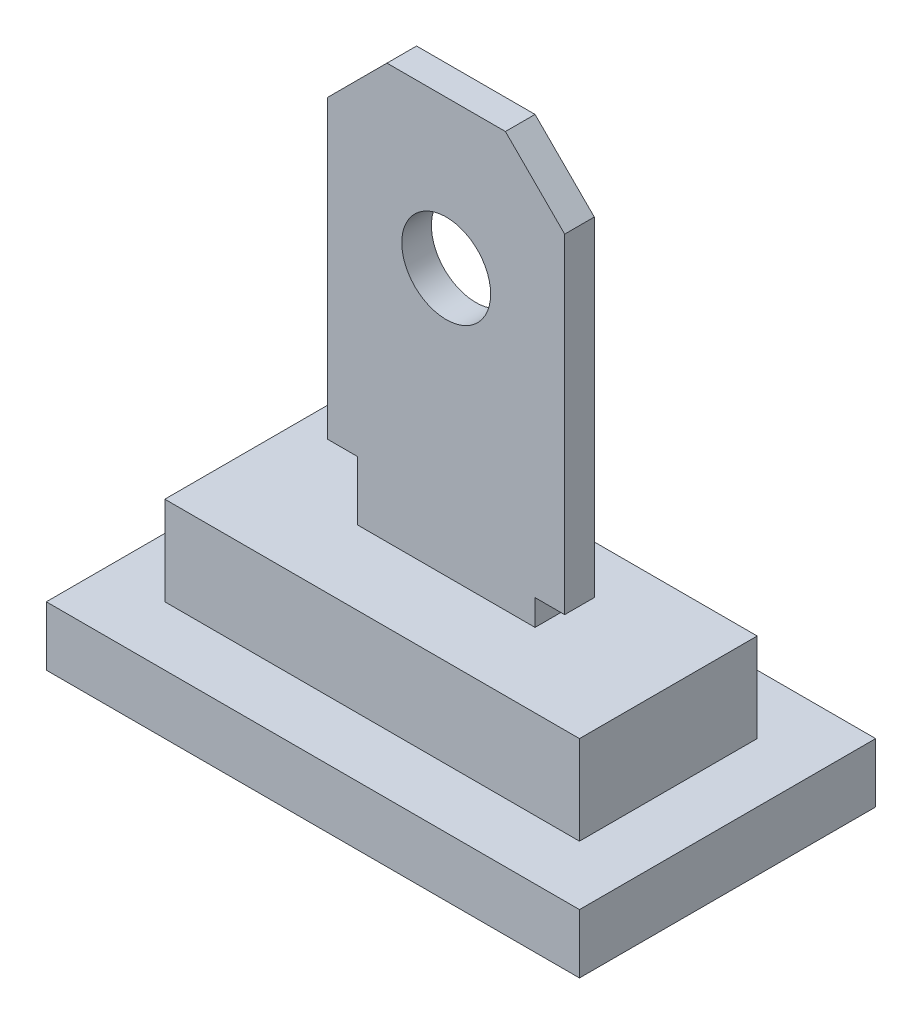
ISO-10303-21;
HEADER;
FILE_DESCRIPTION(('STEP AP214'),'2;1');
FILE_NAME('part.step','',(''),(''),'','','');
FILE_SCHEMA(('AUTOMOTIVE_DESIGN { 1 0 10303 214 1 1 1 1 }'));
ENDSEC;
DATA;
#1=APPLICATION_CONTEXT('core data for automotive mechanical design processes');
#2=APPLICATION_PROTOCOL_DEFINITION('international standard','automotive_design',2000,#1);
#3=PRODUCT_CONTEXT('',#1,'mechanical');
#4=PRODUCT('Part','Part','',(#3));
#5=PRODUCT_RELATED_PRODUCT_CATEGORY('part','',(#4));
#6=PRODUCT_DEFINITION_FORMATION('','',#4);
#7=PRODUCT_DEFINITION_CONTEXT('part definition',#1,'design');
#8=PRODUCT_DEFINITION('design','',#6,#7);
#9=PRODUCT_DEFINITION_SHAPE('','',#8);
#10=(LENGTH_UNIT() NAMED_UNIT(*) SI_UNIT(.MILLI.,.METRE.));
#11=(NAMED_UNIT(*) PLANE_ANGLE_UNIT() SI_UNIT($,.RADIAN.));
#12=(NAMED_UNIT(*) SI_UNIT($,.STERADIAN.) SOLID_ANGLE_UNIT());
#13=UNCERTAINTY_MEASURE_WITH_UNIT(LENGTH_MEASURE(1.E-05),#10,'distance_accuracy_value','');
#14=(GEOMETRIC_REPRESENTATION_CONTEXT(3) GLOBAL_UNCERTAINTY_ASSIGNED_CONTEXT((#13)) GLOBAL_UNIT_ASSIGNED_CONTEXT((#10,
#11,#12)) REPRESENTATION_CONTEXT('',''));
#15=CARTESIAN_POINT('',(0.,0.,0.));
#16=DIRECTION('',(0.,0.,1.));
#17=DIRECTION('',(1.,0.,0.));
#18=AXIS2_PLACEMENT_3D('',#15,#16,#17);
#19=CARTESIAN_POINT('',(0.,1.5,0.));
#20=DIRECTION('',(0.,1.,0.));
#21=DIRECTION('',(0.,0.,1.));
#22=AXIS2_PLACEMENT_3D('',#19,#20,#21);
#23=PLANE('',#22);
#24=DIRECTION('',(0.,0.,-1.));
#25=VECTOR('',#24,1.);
#26=CARTESIAN_POINT('',(3.5,1.5,-1.5));
#27=LINE('',#26,#25);
#28=CARTESIAN_POINT('',(3.5,1.5,1.5));
#29=VERTEX_POINT('',#28);
#30=CARTESIAN_POINT('',(3.5,1.5,-1.5));
#31=VERTEX_POINT('',#30);
#32=EDGE_CURVE('E89',#29,#31,#27,.T.);
#33=ORIENTED_EDGE('',*,*,#32,.T.);
#34=DIRECTION('',(-1.,0.,0.));
#35=VECTOR('',#34,1.);
#36=CARTESIAN_POINT('',(-3.5,1.5,-1.5));
#37=LINE('',#36,#35);
#38=CARTESIAN_POINT('',(-3.5,1.5,-1.5));
#39=VERTEX_POINT('',#38);
#40=EDGE_CURVE('E82',#31,#39,#37,.T.);
#41=ORIENTED_EDGE('',*,*,#40,.T.);
#42=DIRECTION('',(0.,0.,1.));
#43=VECTOR('',#42,1.);
#44=CARTESIAN_POINT('',(-3.5,1.5,-1.5));
#45=LINE('',#44,#43);
#46=CARTESIAN_POINT('',(-3.5,1.5,1.5));
#47=VERTEX_POINT('',#46);
#48=EDGE_CURVE('E86',#39,#47,#45,.T.);
#49=ORIENTED_EDGE('',*,*,#48,.T.);
#50=DIRECTION('',(1.,0.,0.));
#51=VECTOR('',#50,1.);
#52=CARTESIAN_POINT('',(-3.5,1.5,1.5));
#53=LINE('',#52,#51);
#54=EDGE_CURVE('E56',#47,#29,#53,.T.);
#55=ORIENTED_EDGE('',*,*,#54,.T.);
#56=EDGE_LOOP('',(#33,#41,#49,#55));
#57=FACE_BOUND('',#56,.T.);
#58=DIRECTION('',(1.,0.,0.));
#59=VECTOR('',#58,1.);
#60=CARTESIAN_POINT('',(1.5,1.5,-0.25));
#61=LINE('',#60,#59);
#62=CARTESIAN_POINT('',(-1.5,1.5,-0.25));
#63=VERTEX_POINT('',#62);
#64=CARTESIAN_POINT('',(1.5,1.5,-0.25));
#65=VERTEX_POINT('',#64);
#66=EDGE_CURVE('E47',#63,#65,#61,.T.);
#67=ORIENTED_EDGE('',*,*,#66,.T.);
#68=DIRECTION('',(0.,0.,-1.));
#69=VECTOR('',#68,1.);
#70=CARTESIAN_POINT('',(1.5,1.5,0.25));
#71=LINE('',#70,#69);
#72=CARTESIAN_POINT('',(1.5,1.5,0.25));
#73=VERTEX_POINT('',#72);
#74=EDGE_CURVE('E203',#73,#65,#71,.T.);
#75=ORIENTED_EDGE('',*,*,#74,.F.);
#76=DIRECTION('',(1.,0.,0.));
#77=VECTOR('',#76,1.);
#78=CARTESIAN_POINT('',(1.5,1.5,0.25));
#79=LINE('',#78,#77);
#80=CARTESIAN_POINT('',(-1.5,1.5,0.25));
#81=VERTEX_POINT('',#80);
#82=EDGE_CURVE('E209',#81,#73,#79,.T.);
#83=ORIENTED_EDGE('',*,*,#82,.F.);
#84=DIRECTION('',(0.,0.,-1.));
#85=VECTOR('',#84,1.);
#86=CARTESIAN_POINT('',(-1.5,1.5,0.25));
#87=LINE('',#86,#85);
#88=EDGE_CURVE('E484',#81,#63,#87,.T.);
#89=ORIENTED_EDGE('',*,*,#88,.T.);
#90=EDGE_LOOP('',(#67,#75,#83,#89));
#91=FACE_BOUND('',#90,.T.);
#92=ADVANCED_FACE('F32',(#57,#91),#23,.T.);
#93=CARTESIAN_POINT('',(3.5,1.5,-1.5));
#94=DIRECTION('',(-1.,0.,0.));
#95=DIRECTION('',(0.,0.,1.));
#96=AXIS2_PLACEMENT_3D('',#93,#94,#95);
#97=PLANE('',#96);
#98=DIRECTION('',(0.,0.,-1.));
#99=VECTOR('',#98,1.);
#100=CARTESIAN_POINT('',(3.5,0.,-1.5));
#101=LINE('',#100,#99);
#102=CARTESIAN_POINT('',(3.5,0.,1.5));
#103=VERTEX_POINT('',#102);
#104=CARTESIAN_POINT('',(3.5,0.,-1.5));
#105=VERTEX_POINT('',#104);
#106=EDGE_CURVE('E69',#103,#105,#101,.T.);
#107=ORIENTED_EDGE('',*,*,#106,.T.);
#108=DIRECTION('',(0.,-1.,0.));
#109=VECTOR('',#108,1.);
#110=CARTESIAN_POINT('',(3.5,1.5,-1.5));
#111=LINE('',#110,#109);
#112=EDGE_CURVE('E11',#31,#105,#111,.T.);
#113=ORIENTED_EDGE('',*,*,#112,.F.);
#114=ORIENTED_EDGE('',*,*,#32,.F.);
#115=DIRECTION('',(0.,-1.,0.));
#116=VECTOR('',#115,1.);
#117=CARTESIAN_POINT('',(3.5,1.5,1.5));
#118=LINE('',#117,#116);
#119=EDGE_CURVE('E101',#29,#103,#118,.T.);
#120=ORIENTED_EDGE('',*,*,#119,.T.);
#121=EDGE_LOOP('',(#107,#113,#114,#120));
#122=FACE_BOUND('',#121,.T.);
#123=ADVANCED_FACE('F34',(#122),#97,.F.);
#124=CARTESIAN_POINT('',(-3.5,1.5,-1.5));
#125=DIRECTION('',(0.,0.,1.));
#126=DIRECTION('',(1.,0.,0.));
#127=AXIS2_PLACEMENT_3D('',#124,#125,#126);
#128=PLANE('',#127);
#129=DIRECTION('',(-1.,0.,0.));
#130=VECTOR('',#129,1.);
#131=CARTESIAN_POINT('',(-3.5,0.,-1.5));
#132=LINE('',#131,#130);
#133=CARTESIAN_POINT('',(-3.5,0.,-1.5));
#134=VERTEX_POINT('',#133);
#135=EDGE_CURVE('E77',#105,#134,#132,.T.);
#136=ORIENTED_EDGE('',*,*,#135,.T.);
#137=DIRECTION('',(0.,-1.,0.));
#138=VECTOR('',#137,1.);
#139=CARTESIAN_POINT('',(-3.5,1.5,-1.5));
#140=LINE('',#139,#138);
#141=EDGE_CURVE('E40',#39,#134,#140,.T.);
#142=ORIENTED_EDGE('',*,*,#141,.F.);
#143=ORIENTED_EDGE('',*,*,#40,.F.);
#144=ORIENTED_EDGE('',*,*,#112,.T.);
#145=EDGE_LOOP('',(#136,#142,#143,#144));
#146=FACE_BOUND('',#145,.T.);
#147=ADVANCED_FACE('F94',(#146),#128,.F.);
#148=CARTESIAN_POINT('',(-3.5,1.5,-1.5));
#149=DIRECTION('',(1.,0.,0.));
#150=DIRECTION('',(0.,0.,-1.));
#151=AXIS2_PLACEMENT_3D('',#148,#149,#150);
#152=PLANE('',#151);
#153=DIRECTION('',(0.,0.,1.));
#154=VECTOR('',#153,1.);
#155=CARTESIAN_POINT('',(-3.5,0.,-1.5));
#156=LINE('',#155,#154);
#157=CARTESIAN_POINT('',(-3.5,0.,1.5));
#158=VERTEX_POINT('',#157);
#159=EDGE_CURVE('E108',#134,#158,#156,.T.);
#160=ORIENTED_EDGE('',*,*,#159,.T.);
#161=DIRECTION('',(0.,-1.,0.));
#162=VECTOR('',#161,1.);
#163=CARTESIAN_POINT('',(-3.5,1.5,1.5));
#164=LINE('',#163,#162);
#165=EDGE_CURVE('E97',#47,#158,#164,.T.);
#166=ORIENTED_EDGE('',*,*,#165,.F.);
#167=ORIENTED_EDGE('',*,*,#48,.F.);
#168=ORIENTED_EDGE('',*,*,#141,.T.);
#169=EDGE_LOOP('',(#160,#166,#167,#168));
#170=FACE_BOUND('',#169,.T.);
#171=ADVANCED_FACE('F98',(#170),#152,.F.);
#172=CARTESIAN_POINT('',(-3.5,1.5,1.5));
#173=DIRECTION('',(0.,0.,-1.));
#174=DIRECTION('',(-1.,0.,0.));
#175=AXIS2_PLACEMENT_3D('',#172,#173,#174);
#176=PLANE('',#175);
#177=DIRECTION('',(1.,0.,0.));
#178=VECTOR('',#177,1.);
#179=CARTESIAN_POINT('',(-3.5,0.,1.5));
#180=LINE('',#179,#178);
#181=EDGE_CURVE('E110',#158,#103,#180,.T.);
#182=ORIENTED_EDGE('',*,*,#181,.T.);
#183=ORIENTED_EDGE('',*,*,#119,.F.);
#184=ORIENTED_EDGE('',*,*,#54,.F.);
#185=ORIENTED_EDGE('',*,*,#165,.T.);
#186=EDGE_LOOP('',(#182,#183,#184,#185));
#187=FACE_BOUND('',#186,.T.);
#188=ADVANCED_FACE('F115',(#187),#176,.F.);
#189=CARTESIAN_POINT('',(0.,0.,0.));
#190=DIRECTION('',(0.,-1.,0.));
#191=DIRECTION('',(0.,0.,-1.));
#192=AXIS2_PLACEMENT_3D('',#189,#190,#191);
#193=PLANE('',#192);
#194=DIRECTION('',(0.,0.,1.));
#195=VECTOR('',#194,1.);
#196=CARTESIAN_POINT('',(4.5,0.,2.5));
#197=LINE('',#196,#195);
#198=CARTESIAN_POINT('',(4.5,0.,-2.5));
#199=VERTEX_POINT('',#198);
#200=CARTESIAN_POINT('',(4.5,0.,2.5));
#201=VERTEX_POINT('',#200);
#202=EDGE_CURVE('E220',#199,#201,#197,.T.);
#203=ORIENTED_EDGE('',*,*,#202,.F.);
#204=DIRECTION('',(1.,0.,0.));
#205=VECTOR('',#204,1.);
#206=CARTESIAN_POINT('',(-4.5,0.,-2.5));
#207=LINE('',#206,#205);
#208=CARTESIAN_POINT('',(-4.5,0.,-2.5));
#209=VERTEX_POINT('',#208);
#210=EDGE_CURVE('E233',#209,#199,#207,.T.);
#211=ORIENTED_EDGE('',*,*,#210,.F.);
#212=DIRECTION('',(0.,0.,-1.));
#213=VECTOR('',#212,1.);
#214=CARTESIAN_POINT('',(-4.5,0.,2.5));
#215=LINE('',#214,#213);
#216=CARTESIAN_POINT('',(-4.5,0.,2.5));
#217=VERTEX_POINT('',#216);
#218=EDGE_CURVE('E241',#217,#209,#215,.T.);
#219=ORIENTED_EDGE('',*,*,#218,.F.);
#220=DIRECTION('',(-1.,0.,0.));
#221=VECTOR('',#220,1.);
#222=CARTESIAN_POINT('',(-4.5,0.,2.5));
#223=LINE('',#222,#221);
#224=EDGE_CURVE('E223',#201,#217,#223,.T.);
#225=ORIENTED_EDGE('',*,*,#224,.F.);
#226=EDGE_LOOP('',(#203,#211,#219,#225));
#227=FACE_BOUND('',#226,.T.);
#228=ORIENTED_EDGE('',*,*,#135,.F.);
#229=ORIENTED_EDGE('',*,*,#106,.F.);
#230=ORIENTED_EDGE('',*,*,#181,.F.);
#231=ORIENTED_EDGE('',*,*,#159,.F.);
#232=EDGE_LOOP('',(#228,#229,#230,#231));
#233=FACE_BOUND('',#232,.T.);
#234=ADVANCED_FACE('F264',(#227,#233),#193,.F.);
#235=CARTESIAN_POINT('',(4.5,-1.,2.5));
#236=DIRECTION('',(-1.,0.,0.));
#237=DIRECTION('',(0.,0.,1.));
#238=AXIS2_PLACEMENT_3D('',#235,#236,#237);
#239=PLANE('',#238);
#240=ORIENTED_EDGE('',*,*,#202,.T.);
#241=DIRECTION('',(0.,1.,0.));
#242=VECTOR('',#241,1.);
#243=CARTESIAN_POINT('',(4.5,-1.,2.5));
#244=LINE('',#243,#242);
#245=CARTESIAN_POINT('',(4.5,-1.,2.5));
#246=VERTEX_POINT('',#245);
#247=EDGE_CURVE('E106',#246,#201,#244,.T.);
#248=ORIENTED_EDGE('',*,*,#247,.F.);
#249=DIRECTION('',(0.,0.,1.));
#250=VECTOR('',#249,1.);
#251=CARTESIAN_POINT('',(4.5,-1.,2.5));
#252=LINE('',#251,#250);
#253=CARTESIAN_POINT('',(4.5,-1.,-2.5));
#254=VERTEX_POINT('',#253);
#255=EDGE_CURVE('E229',#254,#246,#252,.T.);
#256=ORIENTED_EDGE('',*,*,#255,.F.);
#257=DIRECTION('',(0.,1.,0.));
#258=VECTOR('',#257,1.);
#259=CARTESIAN_POINT('',(4.5,-1.,-2.5));
#260=LINE('',#259,#258);
#261=EDGE_CURVE('E238',#254,#199,#260,.T.);
#262=ORIENTED_EDGE('',*,*,#261,.T.);
#263=EDGE_LOOP('',(#240,#248,#256,#262));
#264=FACE_BOUND('',#263,.T.);
#265=ADVANCED_FACE('F260',(#264),#239,.F.);
#266=CARTESIAN_POINT('',(-4.5,-1.,2.5));
#267=DIRECTION('',(0.,0.,-1.));
#268=DIRECTION('',(-1.,0.,0.));
#269=AXIS2_PLACEMENT_3D('',#266,#267,#268);
#270=PLANE('',#269);
#271=ORIENTED_EDGE('',*,*,#224,.T.);
#272=DIRECTION('',(0.,1.,0.));
#273=VECTOR('',#272,1.);
#274=CARTESIAN_POINT('',(-4.5,-1.,2.5));
#275=LINE('',#274,#273);
#276=CARTESIAN_POINT('',(-4.5,-1.,2.5));
#277=VERTEX_POINT('',#276);
#278=EDGE_CURVE('E249',#277,#217,#275,.T.);
#279=ORIENTED_EDGE('',*,*,#278,.F.);
#280=DIRECTION('',(-1.,0.,0.));
#281=VECTOR('',#280,1.);
#282=CARTESIAN_POINT('',(-4.5,-1.,2.5));
#283=LINE('',#282,#281);
#284=EDGE_CURVE('E232',#246,#277,#283,.T.);
#285=ORIENTED_EDGE('',*,*,#284,.F.);
#286=ORIENTED_EDGE('',*,*,#247,.T.);
#287=EDGE_LOOP('',(#271,#279,#285,#286));
#288=FACE_BOUND('',#287,.T.);
#289=ADVANCED_FACE('F255',(#288),#270,.F.);
#290=CARTESIAN_POINT('',(-4.5,-1.,2.5));
#291=DIRECTION('',(1.,0.,0.));
#292=DIRECTION('',(0.,0.,-1.));
#293=AXIS2_PLACEMENT_3D('',#290,#291,#292);
#294=PLANE('',#293);
#295=ORIENTED_EDGE('',*,*,#218,.T.);
#296=DIRECTION('',(0.,1.,0.));
#297=VECTOR('',#296,1.);
#298=CARTESIAN_POINT('',(-4.5,-1.,-2.5));
#299=LINE('',#298,#297);
#300=CARTESIAN_POINT('',(-4.5,-1.,-2.5));
#301=VERTEX_POINT('',#300);
#302=EDGE_CURVE('E246',#301,#209,#299,.T.);
#303=ORIENTED_EDGE('',*,*,#302,.F.);
#304=DIRECTION('',(0.,0.,-1.));
#305=VECTOR('',#304,1.);
#306=CARTESIAN_POINT('',(-4.5,-1.,2.5));
#307=LINE('',#306,#305);
#308=EDGE_CURVE('E235',#277,#301,#307,.T.);
#309=ORIENTED_EDGE('',*,*,#308,.F.);
#310=ORIENTED_EDGE('',*,*,#278,.T.);
#311=EDGE_LOOP('',(#295,#303,#309,#310));
#312=FACE_BOUND('',#311,.T.);
#313=ADVANCED_FACE('F268',(#312),#294,.F.);
#314=CARTESIAN_POINT('',(-4.5,-1.,-2.5));
#315=DIRECTION('',(0.,0.,1.));
#316=DIRECTION('',(1.,0.,0.));
#317=AXIS2_PLACEMENT_3D('',#314,#315,#316);
#318=PLANE('',#317);
#319=ORIENTED_EDGE('',*,*,#210,.T.);
#320=ORIENTED_EDGE('',*,*,#261,.F.);
#321=DIRECTION('',(1.,0.,0.));
#322=VECTOR('',#321,1.);
#323=CARTESIAN_POINT('',(-4.5,-1.,-2.5));
#324=LINE('',#323,#322);
#325=EDGE_CURVE('E237',#301,#254,#324,.T.);
#326=ORIENTED_EDGE('',*,*,#325,.F.);
#327=ORIENTED_EDGE('',*,*,#302,.T.);
#328=EDGE_LOOP('',(#319,#320,#326,#327));
#329=FACE_BOUND('',#328,.T.);
#330=ADVANCED_FACE('F272',(#329),#318,.F.);
#331=CARTESIAN_POINT('',(0.,-1.,0.));
#332=DIRECTION('',(0.,-1.,0.));
#333=DIRECTION('',(0.,0.,-1.));
#334=AXIS2_PLACEMENT_3D('',#331,#332,#333);
#335=PLANE('',#334);
#336=ORIENTED_EDGE('',*,*,#255,.T.);
#337=ORIENTED_EDGE('',*,*,#284,.T.);
#338=ORIENTED_EDGE('',*,*,#308,.T.);
#339=ORIENTED_EDGE('',*,*,#325,.T.);
#340=EDGE_LOOP('',(#336,#337,#338,#339));
#341=FACE_BOUND('',#340,.T.);
#342=ADVANCED_FACE('F274',(#341),#335,.T.);
#343=CARTESIAN_POINT('',(0.,0.,0.25));
#344=DIRECTION('',(0.,0.,-1.));
#345=DIRECTION('',(-1.,0.,0.));
#346=AXIS2_PLACEMENT_3D('',#343,#344,#345);
#347=PLANE('',#346);
#348=ORIENTED_EDGE('',*,*,#82,.T.);
#349=DIRECTION('',(0.,1.,0.));
#350=VECTOR('',#349,1.);
#351=CARTESIAN_POINT('',(1.5,1.9363915112357,0.25));
#352=LINE('',#351,#350);
#353=CARTESIAN_POINT('',(1.5,1.9363915112357,0.25));
#354=VERTEX_POINT('',#353);
#355=EDGE_CURVE('E199',#73,#354,#352,.T.);
#356=ORIENTED_EDGE('',*,*,#355,.T.);
#357=DIRECTION('',(1.,0.,0.));
#358=VECTOR('',#357,1.);
#359=CARTESIAN_POINT('',(2.,1.9363915112357,0.25));
#360=LINE('',#359,#358);
#361=CARTESIAN_POINT('',(2.,1.9363915112357,0.25));
#362=VERTEX_POINT('',#361);
#363=EDGE_CURVE('E208',#354,#362,#360,.T.);
#364=ORIENTED_EDGE('',*,*,#363,.T.);
#365=DIRECTION('',(0.,1.,0.));
#366=VECTOR('',#365,1.);
#367=CARTESIAN_POINT('',(2.,7.50000000000001,0.25));
#368=LINE('',#367,#366);
#369=CARTESIAN_POINT('',(2.,7.50000000000001,0.25));
#370=VERTEX_POINT('',#369);
#371=EDGE_CURVE('E471',#362,#370,#368,.T.);
#372=ORIENTED_EDGE('',*,*,#371,.T.);
#373=DIRECTION('',(-0.707106781186549,0.707106781186546,0.));
#374=VECTOR('',#373,1.);
#375=CARTESIAN_POINT('',(1.,8.5,0.25));
#376=LINE('',#375,#374);
#377=CARTESIAN_POINT('',(1.,8.5,0.25));
#378=VERTEX_POINT('',#377);
#379=EDGE_CURVE('E473',#370,#378,#376,.T.);
#380=ORIENTED_EDGE('',*,*,#379,.T.);
#381=DIRECTION('',(-1.,0.,0.));
#382=VECTOR('',#381,1.);
#383=CARTESIAN_POINT('',(-1.,8.5,0.25));
#384=LINE('',#383,#382);
#385=CARTESIAN_POINT('',(-1.,8.5,0.25));
#386=VERTEX_POINT('',#385);
#387=EDGE_CURVE('E475',#378,#386,#384,.T.);
#388=ORIENTED_EDGE('',*,*,#387,.T.);
#389=DIRECTION('',(-0.707106781186548,-0.707106781186547,0.));
#390=VECTOR('',#389,1.);
#391=CARTESIAN_POINT('',(-2.,7.5,0.25));
#392=LINE('',#391,#390);
#393=CARTESIAN_POINT('',(-2.,7.5,0.25));
#394=VERTEX_POINT('',#393);
#395=EDGE_CURVE('E477',#386,#394,#392,.T.);
#396=ORIENTED_EDGE('',*,*,#395,.T.);
#397=DIRECTION('',(0.,-1.,0.));
#398=VECTOR('',#397,1.);
#399=CARTESIAN_POINT('',(-2.,2.5,0.25));
#400=LINE('',#399,#398);
#401=CARTESIAN_POINT('',(-2.,2.5,0.25));
#402=VERTEX_POINT('',#401);
#403=EDGE_CURVE('E479',#394,#402,#400,.T.);
#404=ORIENTED_EDGE('',*,*,#403,.T.);
#405=DIRECTION('',(1.,0.,0.));
#406=VECTOR('',#405,1.);
#407=CARTESIAN_POINT('',(-1.5,2.5,0.25));
#408=LINE('',#407,#406);
#409=CARTESIAN_POINT('',(-1.5,2.5,0.25));
#410=VERTEX_POINT('',#409);
#411=EDGE_CURVE('E481',#402,#410,#408,.T.);
#412=ORIENTED_EDGE('',*,*,#411,.T.);
#413=DIRECTION('',(0.,-1.,0.));
#414=VECTOR('',#413,1.);
#415=CARTESIAN_POINT('',(-1.5,1.5,0.25));
#416=LINE('',#415,#414);
#417=EDGE_CURVE('E215',#410,#81,#416,.T.);
#418=ORIENTED_EDGE('',*,*,#417,.T.);
#419=EDGE_LOOP('',(#348,#356,#364,#372,#380,#388,#396,#404,#412,#418));
#420=FACE_BOUND('',#419,.T.);
#421=CARTESIAN_POINT('',(0.,6.,0.25));
#422=DIRECTION('',(0.,0.,1.));
#423=DIRECTION('',(1.,0.,0.));
#424=AXIS2_PLACEMENT_3D('',#421,#422,#423);
#425=CIRCLE('',#424,0.75);
#426=CARTESIAN_POINT('',(0.75,6.,0.25));
#427=VERTEX_POINT('',#426);
#428=EDGE_CURVE('E462',#427,#427,#425,.T.);
#429=ORIENTED_EDGE('',*,*,#428,.F.);
#430=EDGE_LOOP('',(#429));
#431=FACE_BOUND('',#430,.T.);
#432=ADVANCED_FACE('F212',(#420,#431),#347,.F.);
#433=CARTESIAN_POINT('',(0.,0.,-0.25));
#434=DIRECTION('',(0.,0.,-1.));
#435=DIRECTION('',(-1.,0.,0.));
#436=AXIS2_PLACEMENT_3D('',#433,#434,#435);
#437=PLANE('',#436);
#438=ORIENTED_EDGE('',*,*,#66,.F.);
#439=DIRECTION('',(0.,-1.,0.));
#440=VECTOR('',#439,1.);
#441=CARTESIAN_POINT('',(-1.5,1.5,-0.25));
#442=LINE('',#441,#440);
#443=CARTESIAN_POINT('',(-1.5,2.5,-0.25));
#444=VERTEX_POINT('',#443);
#445=EDGE_CURVE('E218',#444,#63,#442,.T.);
#446=ORIENTED_EDGE('',*,*,#445,.F.);
#447=DIRECTION('',(1.,0.,0.));
#448=VECTOR('',#447,1.);
#449=CARTESIAN_POINT('',(-1.5,2.5,-0.25));
#450=LINE('',#449,#448);
#451=CARTESIAN_POINT('',(-2.,2.5,-0.25));
#452=VERTEX_POINT('',#451);
#453=EDGE_CURVE('E500',#452,#444,#450,.T.);
#454=ORIENTED_EDGE('',*,*,#453,.F.);
#455=DIRECTION('',(0.,-1.,0.));
#456=VECTOR('',#455,1.);
#457=CARTESIAN_POINT('',(-2.,2.5,-0.25));
#458=LINE('',#457,#456);
#459=CARTESIAN_POINT('',(-2.,7.5,-0.25));
#460=VERTEX_POINT('',#459);
#461=EDGE_CURVE('E498',#460,#452,#458,.T.);
#462=ORIENTED_EDGE('',*,*,#461,.F.);
#463=DIRECTION('',(-0.707106781186548,-0.707106781186547,0.));
#464=VECTOR('',#463,1.);
#465=CARTESIAN_POINT('',(-2.,7.5,-0.25));
#466=LINE('',#465,#464);
#467=CARTESIAN_POINT('',(-1.,8.5,-0.25));
#468=VERTEX_POINT('',#467);
#469=EDGE_CURVE('E496',#468,#460,#466,.T.);
#470=ORIENTED_EDGE('',*,*,#469,.F.);
#471=DIRECTION('',(-1.,0.,0.));
#472=VECTOR('',#471,1.);
#473=CARTESIAN_POINT('',(-1.,8.5,-0.25));
#474=LINE('',#473,#472);
#475=CARTESIAN_POINT('',(1.,8.5,-0.25));
#476=VERTEX_POINT('',#475);
#477=EDGE_CURVE('E494',#476,#468,#474,.T.);
#478=ORIENTED_EDGE('',*,*,#477,.F.);
#479=DIRECTION('',(-0.707106781186549,0.707106781186546,0.));
#480=VECTOR('',#479,1.);
#481=CARTESIAN_POINT('',(1.,8.5,-0.25));
#482=LINE('',#481,#480);
#483=CARTESIAN_POINT('',(2.,7.50000000000001,-0.25));
#484=VERTEX_POINT('',#483);
#485=EDGE_CURVE('E492',#484,#476,#482,.T.);
#486=ORIENTED_EDGE('',*,*,#485,.F.);
#487=DIRECTION('',(0.,1.,0.));
#488=VECTOR('',#487,1.);
#489=CARTESIAN_POINT('',(2.,7.50000000000001,-0.25));
#490=LINE('',#489,#488);
#491=CARTESIAN_POINT('',(2.,1.9363915112357,-0.25));
#492=VERTEX_POINT('',#491);
#493=EDGE_CURVE('E490',#492,#484,#490,.T.);
#494=ORIENTED_EDGE('',*,*,#493,.F.);
#495=DIRECTION('',(1.,0.,0.));
#496=VECTOR('',#495,1.);
#497=CARTESIAN_POINT('',(2.,1.9363915112357,-0.25));
#498=LINE('',#497,#496);
#499=CARTESIAN_POINT('',(1.5,1.9363915112357,-0.25));
#500=VERTEX_POINT('',#499);
#501=EDGE_CURVE('E488',#500,#492,#498,.T.);
#502=ORIENTED_EDGE('',*,*,#501,.F.);
#503=DIRECTION('',(0.,1.,0.));
#504=VECTOR('',#503,1.);
#505=CARTESIAN_POINT('',(1.5,1.9363915112357,-0.25));
#506=LINE('',#505,#504);
#507=EDGE_CURVE('E486',#65,#500,#506,.T.);
#508=ORIENTED_EDGE('',*,*,#507,.F.);
#509=EDGE_LOOP('',(#438,#446,#454,#462,#470,#478,#486,#494,#502,#508));
#510=FACE_BOUND('',#509,.T.);
#511=CARTESIAN_POINT('',(0.,6.,-0.25));
#512=DIRECTION('',(0.,0.,1.));
#513=DIRECTION('',(1.,0.,0.));
#514=AXIS2_PLACEMENT_3D('',#511,#512,#513);
#515=CIRCLE('',#514,0.75);
#516=CARTESIAN_POINT('',(0.75,6.,-0.25));
#517=VERTEX_POINT('',#516);
#518=EDGE_CURVE('E465',#517,#517,#515,.T.);
#519=ORIENTED_EDGE('',*,*,#518,.T.);
#520=EDGE_LOOP('',(#519));
#521=FACE_BOUND('',#520,.T.);
#522=ADVANCED_FACE('F281',(#510,#521),#437,.T.);
#523=CARTESIAN_POINT('',(1.5,1.9363915112357,0.25));
#524=DIRECTION('',(-1.,0.,0.));
#525=DIRECTION('',(0.,-1.,0.));
#526=AXIS2_PLACEMENT_3D('',#523,#524,#525);
#527=PLANE('',#526);
#528=ORIENTED_EDGE('',*,*,#507,.T.);
#529=DIRECTION('',(0.,0.,-1.));
#530=VECTOR('',#529,1.);
#531=CARTESIAN_POINT('',(1.5,1.9363915112357,0.25));
#532=LINE('',#531,#530);
#533=EDGE_CURVE('E205',#354,#500,#532,.T.);
#534=ORIENTED_EDGE('',*,*,#533,.F.);
#535=ORIENTED_EDGE('',*,*,#355,.F.);
#536=ORIENTED_EDGE('',*,*,#74,.T.);
#537=EDGE_LOOP('',(#528,#534,#535,#536));
#538=FACE_BOUND('',#537,.T.);
#539=ADVANCED_FACE('F201',(#538),#527,.F.);
#540=CARTESIAN_POINT('',(2.,1.9363915112357,0.25));
#541=DIRECTION('',(0.,1.,0.));
#542=DIRECTION('',(0.,0.,1.));
#543=AXIS2_PLACEMENT_3D('',#540,#541,#542);
#544=PLANE('',#543);
#545=ORIENTED_EDGE('',*,*,#501,.T.);
#546=DIRECTION('',(0.,0.,-1.));
#547=VECTOR('',#546,1.);
#548=CARTESIAN_POINT('',(2.,1.9363915112357,0.25));
#549=LINE('',#548,#547);
#550=EDGE_CURVE('E225',#362,#492,#549,.T.);
#551=ORIENTED_EDGE('',*,*,#550,.F.);
#552=ORIENTED_EDGE('',*,*,#363,.F.);
#553=ORIENTED_EDGE('',*,*,#533,.T.);
#554=EDGE_LOOP('',(#545,#551,#552,#553));
#555=FACE_BOUND('',#554,.T.);
#556=ADVANCED_FACE('F367',(#555),#544,.F.);
#557=CARTESIAN_POINT('',(2.,7.50000000000001,0.25));
#558=DIRECTION('',(-1.,0.,0.));
#559=DIRECTION('',(0.,-1.,0.));
#560=AXIS2_PLACEMENT_3D('',#557,#558,#559);
#561=PLANE('',#560);
#562=ORIENTED_EDGE('',*,*,#493,.T.);
#563=DIRECTION('',(0.,0.,-1.));
#564=VECTOR('',#563,1.);
#565=CARTESIAN_POINT('',(2.,7.50000000000001,0.25));
#566=LINE('',#565,#564);
#567=EDGE_CURVE('E519',#370,#484,#566,.T.);
#568=ORIENTED_EDGE('',*,*,#567,.F.);
#569=ORIENTED_EDGE('',*,*,#371,.F.);
#570=ORIENTED_EDGE('',*,*,#550,.T.);
#571=EDGE_LOOP('',(#562,#568,#569,#570));
#572=FACE_BOUND('',#571,.T.);
#573=ADVANCED_FACE('F375',(#572),#561,.F.);
#574=CARTESIAN_POINT('',(1.,8.5,0.25));
#575=DIRECTION('',(-0.707106781186546,-0.707106781186549,0.));
#576=DIRECTION('',(0.707106781186549,-0.707106781186546,0.));
#577=AXIS2_PLACEMENT_3D('',#574,#575,#576);
#578=PLANE('',#577);
#579=ORIENTED_EDGE('',*,*,#485,.T.);
#580=DIRECTION('',(0.,0.,-1.));
#581=VECTOR('',#580,1.);
#582=CARTESIAN_POINT('',(1.,8.5,0.25));
#583=LINE('',#582,#581);
#584=EDGE_CURVE('E516',#378,#476,#583,.T.);
#585=ORIENTED_EDGE('',*,*,#584,.F.);
#586=ORIENTED_EDGE('',*,*,#379,.F.);
#587=ORIENTED_EDGE('',*,*,#567,.T.);
#588=EDGE_LOOP('',(#579,#585,#586,#587));
#589=FACE_BOUND('',#588,.T.);
#590=ADVANCED_FACE('F385',(#589),#578,.F.);
#591=CARTESIAN_POINT('',(-1.,8.5,0.25));
#592=DIRECTION('',(0.,-1.,0.));
#593=DIRECTION('',(0.,0.,-1.));
#594=AXIS2_PLACEMENT_3D('',#591,#592,#593);
#595=PLANE('',#594);
#596=ORIENTED_EDGE('',*,*,#477,.T.);
#597=DIRECTION('',(0.,0.,-1.));
#598=VECTOR('',#597,1.);
#599=CARTESIAN_POINT('',(-1.,8.5,0.25));
#600=LINE('',#599,#598);
#601=EDGE_CURVE('E513',#386,#468,#600,.T.);
#602=ORIENTED_EDGE('',*,*,#601,.F.);
#603=ORIENTED_EDGE('',*,*,#387,.F.);
#604=ORIENTED_EDGE('',*,*,#584,.T.);
#605=EDGE_LOOP('',(#596,#602,#603,#604));
#606=FACE_BOUND('',#605,.T.);
#607=ADVANCED_FACE('F395',(#606),#595,.F.);
#608=CARTESIAN_POINT('',(-2.,7.5,0.25));
#609=DIRECTION('',(0.707106781186547,-0.707106781186548,0.));
#610=DIRECTION('',(0.707106781186548,0.707106781186547,0.));
#611=AXIS2_PLACEMENT_3D('',#608,#609,#610);
#612=PLANE('',#611);
#613=ORIENTED_EDGE('',*,*,#469,.T.);
#614=DIRECTION('',(0.,0.,-1.));
#615=VECTOR('',#614,1.);
#616=CARTESIAN_POINT('',(-2.,7.5,0.25));
#617=LINE('',#616,#615);
#618=EDGE_CURVE('E510',#394,#460,#617,.T.);
#619=ORIENTED_EDGE('',*,*,#618,.F.);
#620=ORIENTED_EDGE('',*,*,#395,.F.);
#621=ORIENTED_EDGE('',*,*,#601,.T.);
#622=EDGE_LOOP('',(#613,#619,#620,#621));
#623=FACE_BOUND('',#622,.T.);
#624=ADVANCED_FACE('F405',(#623),#612,.F.);
#625=CARTESIAN_POINT('',(-2.,2.5,0.25));
#626=DIRECTION('',(1.,0.,0.));
#627=DIRECTION('',(0.,0.,-1.));
#628=AXIS2_PLACEMENT_3D('',#625,#626,#627);
#629=PLANE('',#628);
#630=ORIENTED_EDGE('',*,*,#461,.T.);
#631=DIRECTION('',(0.,0.,-1.));
#632=VECTOR('',#631,1.);
#633=CARTESIAN_POINT('',(-2.,2.5,0.25));
#634=LINE('',#633,#632);
#635=EDGE_CURVE('E507',#402,#452,#634,.T.);
#636=ORIENTED_EDGE('',*,*,#635,.F.);
#637=ORIENTED_EDGE('',*,*,#403,.F.);
#638=ORIENTED_EDGE('',*,*,#618,.T.);
#639=EDGE_LOOP('',(#630,#636,#637,#638));
#640=FACE_BOUND('',#639,.T.);
#641=ADVANCED_FACE('F415',(#640),#629,.F.);
#642=CARTESIAN_POINT('',(-1.5,2.5,0.25));
#643=DIRECTION('',(0.,1.,0.));
#644=DIRECTION('',(0.,0.,1.));
#645=AXIS2_PLACEMENT_3D('',#642,#643,#644);
#646=PLANE('',#645);
#647=ORIENTED_EDGE('',*,*,#453,.T.);
#648=DIRECTION('',(0.,0.,-1.));
#649=VECTOR('',#648,1.);
#650=CARTESIAN_POINT('',(-1.5,2.5,0.25));
#651=LINE('',#650,#649);
#652=EDGE_CURVE('E504',#410,#444,#651,.T.);
#653=ORIENTED_EDGE('',*,*,#652,.F.);
#654=ORIENTED_EDGE('',*,*,#411,.F.);
#655=ORIENTED_EDGE('',*,*,#635,.T.);
#656=EDGE_LOOP('',(#647,#653,#654,#655));
#657=FACE_BOUND('',#656,.T.);
#658=ADVANCED_FACE('F425',(#657),#646,.F.);
#659=CARTESIAN_POINT('',(-1.5,1.5,0.25));
#660=DIRECTION('',(1.,0.,0.));
#661=DIRECTION('',(0.,1.,0.));
#662=AXIS2_PLACEMENT_3D('',#659,#660,#661);
#663=PLANE('',#662);
#664=ORIENTED_EDGE('',*,*,#445,.T.);
#665=ORIENTED_EDGE('',*,*,#88,.F.);
#666=ORIENTED_EDGE('',*,*,#417,.F.);
#667=ORIENTED_EDGE('',*,*,#652,.T.);
#668=EDGE_LOOP('',(#664,#665,#666,#667));
#669=FACE_BOUND('',#668,.T.);
#670=ADVANCED_FACE('F435',(#669),#663,.F.);
#671=CARTESIAN_POINT('',(0.,6.,0.25));
#672=DIRECTION('',(0.,0.,-1.));
#673=DIRECTION('',(-1.,0.,0.));
#674=AXIS2_PLACEMENT_3D('',#671,#672,#673);
#675=CYLINDRICAL_SURFACE('',#674,0.75);
#676=ORIENTED_EDGE('',*,*,#428,.T.);
#677=EDGE_LOOP('',(#676));
#678=FACE_BOUND('',#677,.T.);
#679=ORIENTED_EDGE('',*,*,#518,.F.);
#680=EDGE_LOOP('',(#679));
#681=FACE_BOUND('',#680,.T.);
#682=ADVANCED_FACE('F445',(#678,#681),#675,.F.);
#683=CLOSED_SHELL('',(#92,#123,#147,#171,#188,#234,#265,#289,#313,#330,#342,#432,#522,#539,#556,
#573,#590,#607,#624,#641,#658,#670,#682));
#684=MANIFOLD_SOLID_BREP('B2',#683);
#685=ADVANCED_BREP_SHAPE_REPRESENTATION('',(#18,#684),#14);
#686=SHAPE_DEFINITION_REPRESENTATION(#9,#685);
ENDSEC;
END-ISO-10303-21;
